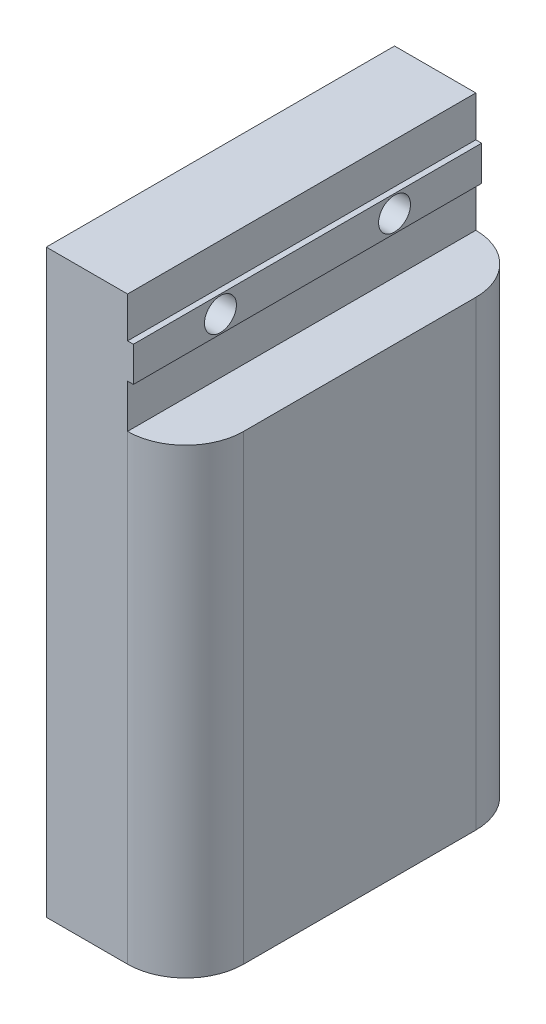
ISO-10303-21;
HEADER;
FILE_DESCRIPTION(('STEP AP214'),'2;1');
FILE_NAME('part.step','',(''),(''),'','','');
FILE_SCHEMA(('AUTOMOTIVE_DESIGN { 1 0 10303 214 1 1 1 1 }'));
ENDSEC;
DATA;
#1=APPLICATION_CONTEXT('core data for automotive mechanical design processes');
#2=APPLICATION_PROTOCOL_DEFINITION('international standard','automotive_design',2000,#1);
#3=PRODUCT_CONTEXT('',#1,'mechanical');
#4=PRODUCT('Part','Part','',(#3));
#5=PRODUCT_RELATED_PRODUCT_CATEGORY('part','',(#4));
#6=PRODUCT_DEFINITION_FORMATION('','',#4);
#7=PRODUCT_DEFINITION_CONTEXT('part definition',#1,'design');
#8=PRODUCT_DEFINITION('design','',#6,#7);
#9=PRODUCT_DEFINITION_SHAPE('','',#8);
#10=(LENGTH_UNIT() NAMED_UNIT(*) SI_UNIT(.MILLI.,.METRE.));
#11=(NAMED_UNIT(*) PLANE_ANGLE_UNIT() SI_UNIT($,.RADIAN.));
#12=(NAMED_UNIT(*) SI_UNIT($,.STERADIAN.) SOLID_ANGLE_UNIT());
#13=UNCERTAINTY_MEASURE_WITH_UNIT(LENGTH_MEASURE(1.E-05),#10,'distance_accuracy_value','');
#14=(GEOMETRIC_REPRESENTATION_CONTEXT(3) GLOBAL_UNCERTAINTY_ASSIGNED_CONTEXT((#13)) GLOBAL_UNIT_ASSIGNED_CONTEXT((#10,
#11,#12)) REPRESENTATION_CONTEXT('',''));
#15=CARTESIAN_POINT('',(0.,0.,0.));
#16=DIRECTION('',(0.,0.,1.));
#17=DIRECTION('',(1.,0.,0.));
#18=AXIS2_PLACEMENT_3D('',#15,#16,#17);
#19=CARTESIAN_POINT('',(24.,-10.,45.));
#20=DIRECTION('',(-1.,0.,0.));
#21=DIRECTION('',(0.,0.,1.));
#22=AXIS2_PLACEMENT_3D('',#19,#20,#21);
#23=CYLINDRICAL_SURFACE('',#22,2.75);
#24=CARTESIAN_POINT('',(15.,-10.,45.));
#25=DIRECTION('',(1.,0.,0.));
#26=DIRECTION('',(0.,0.,-1.));
#27=AXIS2_PLACEMENT_3D('',#24,#25,#26);
#28=CIRCLE('',#27,2.75);
#29=CARTESIAN_POINT('',(15.,-10.,42.25));
#30=VERTEX_POINT('',#29);
#31=EDGE_CURVE('E193',#30,#30,#28,.T.);
#32=ORIENTED_EDGE('',*,*,#31,.T.);
#33=EDGE_LOOP('',(#32));
#34=FACE_BOUND('',#33,.T.);
#35=CARTESIAN_POINT('',(8.,-10.,45.));
#36=DIRECTION('',(-1.,0.,0.));
#37=DIRECTION('',(0.,0.,1.));
#38=AXIS2_PLACEMENT_3D('',#35,#36,#37);
#39=CIRCLE('',#38,2.75);
#40=CARTESIAN_POINT('',(8.,-10.,47.75));
#41=VERTEX_POINT('',#40);
#42=EDGE_CURVE('E197',#41,#41,#39,.F.);
#43=ORIENTED_EDGE('',*,*,#42,.F.);
#44=EDGE_LOOP('',(#43));
#45=FACE_BOUND('',#44,.T.);
#46=ADVANCED_FACE('F39',(#34,#45),#23,.F.);
#47=CARTESIAN_POINT('',(24.,-10.,15.));
#48=DIRECTION('',(-1.,0.,0.));
#49=DIRECTION('',(0.,0.,1.));
#50=AXIS2_PLACEMENT_3D('',#47,#48,#49);
#51=CYLINDRICAL_SURFACE('',#50,2.75);
#52=CARTESIAN_POINT('',(15.,-10.,15.));
#53=DIRECTION('',(1.,0.,0.));
#54=DIRECTION('',(0.,0.,-1.));
#55=AXIS2_PLACEMENT_3D('',#52,#53,#54);
#56=CIRCLE('',#55,2.75);
#57=CARTESIAN_POINT('',(15.,-10.,12.25));
#58=VERTEX_POINT('',#57);
#59=EDGE_CURVE('E196',#58,#58,#56,.T.);
#60=ORIENTED_EDGE('',*,*,#59,.T.);
#61=EDGE_LOOP('',(#60));
#62=FACE_BOUND('',#61,.T.);
#63=CARTESIAN_POINT('',(8.,-10.,15.));
#64=DIRECTION('',(-1.,0.,0.));
#65=DIRECTION('',(0.,0.,1.));
#66=AXIS2_PLACEMENT_3D('',#63,#64,#65);
#67=CIRCLE('',#66,2.75);
#68=CARTESIAN_POINT('',(8.,-10.,17.75));
#69=VERTEX_POINT('',#68);
#70=EDGE_CURVE('E201',#69,#69,#67,.F.);
#71=ORIENTED_EDGE('',*,*,#70,.F.);
#72=EDGE_LOOP('',(#71));
#73=FACE_BOUND('',#72,.T.);
#74=ADVANCED_FACE('F264',(#62,#73),#51,.F.);
#75=CARTESIAN_POINT('',(14.,-20.5,60.));
#76=DIRECTION('',(-1.,0.,0.));
#77=DIRECTION('',(0.,0.,1.));
#78=AXIS2_PLACEMENT_3D('',#75,#76,#77);
#79=PLANE('',#78);
#80=DIRECTION('',(0.,0.,-1.));
#81=VECTOR('',#80,1.);
#82=CARTESIAN_POINT('',(14.,-13.,60.));
#83=LINE('',#82,#81);
#84=CARTESIAN_POINT('',(14.,-13.,60.));
#85=VERTEX_POINT('',#84);
#86=CARTESIAN_POINT('',(14.,-13.,0.));
#87=VERTEX_POINT('',#86);
#88=EDGE_CURVE('E200',#85,#87,#83,.T.);
#89=ORIENTED_EDGE('',*,*,#88,.F.);
#90=DIRECTION('',(0.,1.,0.));
#91=VECTOR('',#90,1.);
#92=CARTESIAN_POINT('',(14.,-20.5,60.));
#93=LINE('',#92,#91);
#94=CARTESIAN_POINT('',(14.,-20.5,60.));
#95=VERTEX_POINT('',#94);
#96=EDGE_CURVE('E149',#95,#85,#93,.T.);
#97=ORIENTED_EDGE('',*,*,#96,.F.);
#98=DIRECTION('',(0.,0.,-1.));
#99=VECTOR('',#98,1.);
#100=CARTESIAN_POINT('',(14.,-20.5,60.));
#101=LINE('',#100,#99);
#102=CARTESIAN_POINT('',(14.,-20.5,0.));
#103=VERTEX_POINT('',#102);
#104=EDGE_CURVE('E180',#95,#103,#101,.T.);
#105=ORIENTED_EDGE('',*,*,#104,.T.);
#106=DIRECTION('',(0.,1.,0.));
#107=VECTOR('',#106,1.);
#108=CARTESIAN_POINT('',(14.,-20.5,0.));
#109=LINE('',#108,#107);
#110=EDGE_CURVE('E172',#103,#87,#109,.T.);
#111=ORIENTED_EDGE('',*,*,#110,.T.);
#112=EDGE_LOOP('',(#89,#97,#105,#111));
#113=FACE_BOUND('',#112,.T.);
#114=ADVANCED_FACE('F229',(#113),#79,.F.);
#115=DIRECTION('',(0.,0.,1.));
#116=VECTOR('',#115,1.);
#117=CARTESIAN_POINT('',(14.,-7.,60.));
#118=LINE('',#117,#116);
#119=CARTESIAN_POINT('',(14.,-6.99999999999999,0.));
#120=VERTEX_POINT('',#119);
#121=CARTESIAN_POINT('',(14.,-6.99999999999999,60.));
#122=VERTEX_POINT('',#121);
#123=EDGE_CURVE('E144',#120,#122,#118,.T.);
#124=ORIENTED_EDGE('',*,*,#123,.F.);
#125=CARTESIAN_POINT('',(14.,0.,0.));
#126=VERTEX_POINT('',#125);
#127=EDGE_CURVE('E171',#120,#126,#109,.T.);
#128=ORIENTED_EDGE('',*,*,#127,.T.);
#129=DIRECTION('',(0.,0.,-1.));
#130=VECTOR('',#129,1.);
#131=CARTESIAN_POINT('',(14.,0.,60.));
#132=LINE('',#131,#130);
#133=CARTESIAN_POINT('',(14.,0.,60.));
#134=VERTEX_POINT('',#133);
#135=EDGE_CURVE('E177',#134,#126,#132,.T.);
#136=ORIENTED_EDGE('',*,*,#135,.F.);
#137=EDGE_CURVE('E165',#122,#134,#93,.T.);
#138=ORIENTED_EDGE('',*,*,#137,.F.);
#139=EDGE_LOOP('',(#124,#128,#136,#138));
#140=FACE_BOUND('',#139,.T.);
#141=ADVANCED_FACE('F247',(#140),#79,.F.);
#142=CARTESIAN_POINT('',(0.,0.,60.));
#143=DIRECTION('',(1.,0.,0.));
#144=DIRECTION('',(0.,1.,0.));
#145=AXIS2_PLACEMENT_3D('',#142,#143,#144);
#146=PLANE('',#145);
#147=CARTESIAN_POINT('',(0.,-10.,15.));
#148=DIRECTION('',(-1.,0.,0.));
#149=DIRECTION('',(0.,0.,1.));
#150=AXIS2_PLACEMENT_3D('',#147,#148,#149);
#151=CIRCLE('',#150,6.);
#152=CARTESIAN_POINT('',(0.,-10.,21.));
#153=VERTEX_POINT('',#152);
#154=EDGE_CURVE('E306',#153,#153,#151,.T.);
#155=ORIENTED_EDGE('',*,*,#154,.F.);
#156=EDGE_LOOP('',(#155));
#157=FACE_BOUND('',#156,.T.);
#158=CARTESIAN_POINT('',(0.,-10.,45.));
#159=DIRECTION('',(-1.,0.,0.));
#160=DIRECTION('',(0.,0.,1.));
#161=AXIS2_PLACEMENT_3D('',#158,#159,#160);
#162=CIRCLE('',#161,6.);
#163=CARTESIAN_POINT('',(0.,-10.,51.));
#164=VERTEX_POINT('',#163);
#165=EDGE_CURVE('E309',#164,#164,#162,.T.);
#166=ORIENTED_EDGE('',*,*,#165,.F.);
#167=EDGE_LOOP('',(#166));
#168=FACE_BOUND('',#167,.T.);
#169=DIRECTION('',(0.,-1.,0.));
#170=VECTOR('',#169,1.);
#171=CARTESIAN_POINT('',(0.,0.,0.));
#172=LINE('',#171,#170);
#173=CARTESIAN_POINT('',(0.,0.,0.));
#174=VERTEX_POINT('',#173);
#175=CARTESIAN_POINT('',(0.,-100.,0.));
#176=VERTEX_POINT('',#175);
#177=EDGE_CURVE('E150',#174,#176,#172,.T.);
#178=ORIENTED_EDGE('',*,*,#177,.T.);
#179=DIRECTION('',(0.,0.,-1.));
#180=VECTOR('',#179,1.);
#181=CARTESIAN_POINT('',(0.,-100.,60.));
#182=LINE('',#181,#180);
#183=CARTESIAN_POINT('',(0.,-100.,60.));
#184=VERTEX_POINT('',#183);
#185=EDGE_CURVE('E189',#184,#176,#182,.T.);
#186=ORIENTED_EDGE('',*,*,#185,.F.);
#187=DIRECTION('',(0.,-1.,0.));
#188=VECTOR('',#187,1.);
#189=CARTESIAN_POINT('',(0.,0.,60.));
#190=LINE('',#189,#188);
#191=CARTESIAN_POINT('',(0.,0.,60.));
#192=VERTEX_POINT('',#191);
#193=EDGE_CURVE('E159',#192,#184,#190,.T.);
#194=ORIENTED_EDGE('',*,*,#193,.F.);
#195=DIRECTION('',(0.,0.,-1.));
#196=VECTOR('',#195,1.);
#197=CARTESIAN_POINT('',(0.,0.,60.));
#198=LINE('',#197,#196);
#199=EDGE_CURVE('E168',#192,#174,#198,.T.);
#200=ORIENTED_EDGE('',*,*,#199,.T.);
#201=EDGE_LOOP('',(#178,#186,#194,#200));
#202=FACE_BOUND('',#201,.T.);
#203=ADVANCED_FACE('F255',(#157,#168,#202),#146,.F.);
#204=CARTESIAN_POINT('',(0.,-100.,60.));
#205=DIRECTION('',(0.,1.,0.));
#206=DIRECTION('',(0.,0.,1.));
#207=AXIS2_PLACEMENT_3D('',#204,#205,#206);
#208=PLANE('',#207);
#209=DIRECTION('',(1.,0.,0.));
#210=VECTOR('',#209,1.);
#211=CARTESIAN_POINT('',(0.,-100.,0.));
#212=LINE('',#211,#210);
#213=CARTESIAN_POINT('',(14.,-100.,0.));
#214=VERTEX_POINT('',#213);
#215=EDGE_CURVE('E153',#176,#214,#212,.T.);
#216=ORIENTED_EDGE('',*,*,#215,.T.);
#217=CARTESIAN_POINT('',(14.,-100.,10.));
#218=DIRECTION('',(0.,1.,0.));
#219=DIRECTION('',(0.,0.,1.));
#220=AXIS2_PLACEMENT_3D('',#217,#218,#219);
#221=CIRCLE('',#220,10.);
#222=CARTESIAN_POINT('',(24.,-100.,10.));
#223=VERTEX_POINT('',#222);
#224=EDGE_CURVE('E47',#214,#223,#221,.F.);
#225=ORIENTED_EDGE('',*,*,#224,.T.);
#226=DIRECTION('',(0.,0.,-1.));
#227=VECTOR('',#226,1.);
#228=CARTESIAN_POINT('',(24.,-100.,60.));
#229=LINE('',#228,#227);
#230=CARTESIAN_POINT('',(24.,-100.,50.));
#231=VERTEX_POINT('',#230);
#232=EDGE_CURVE('E186',#231,#223,#229,.T.);
#233=ORIENTED_EDGE('',*,*,#232,.F.);
#234=CARTESIAN_POINT('',(14.,-100.,50.));
#235=DIRECTION('',(0.,1.,0.));
#236=DIRECTION('',(0.,0.,1.));
#237=AXIS2_PLACEMENT_3D('',#234,#235,#236);
#238=CIRCLE('',#237,10.);
#239=CARTESIAN_POINT('',(14.,-100.,60.));
#240=VERTEX_POINT('',#239);
#241=EDGE_CURVE('E54',#231,#240,#238,.F.);
#242=ORIENTED_EDGE('',*,*,#241,.T.);
#243=DIRECTION('',(1.,0.,0.));
#244=VECTOR('',#243,1.);
#245=CARTESIAN_POINT('',(0.,-100.,60.));
#246=LINE('',#245,#244);
#247=EDGE_CURVE('E162',#184,#240,#246,.T.);
#248=ORIENTED_EDGE('',*,*,#247,.F.);
#249=ORIENTED_EDGE('',*,*,#185,.T.);
#250=EDGE_LOOP('',(#216,#225,#233,#242,#248,#249));
#251=FACE_BOUND('',#250,.T.);
#252=ADVANCED_FACE('F217',(#251),#208,.F.);
#253=CARTESIAN_POINT('',(24.,-100.,60.));
#254=DIRECTION('',(-1.,0.,0.));
#255=DIRECTION('',(0.,0.,1.));
#256=AXIS2_PLACEMENT_3D('',#253,#254,#255);
#257=PLANE('',#256);
#258=ORIENTED_EDGE('',*,*,#232,.T.);
#259=DIRECTION('',(0.,1.,0.));
#260=VECTOR('',#259,1.);
#261=CARTESIAN_POINT('',(24.,-100.,10.));
#262=LINE('',#261,#260);
#263=CARTESIAN_POINT('',(24.,-20.5,10.));
#264=VERTEX_POINT('',#263);
#265=EDGE_CURVE('E208',#223,#264,#262,.T.);
#266=ORIENTED_EDGE('',*,*,#265,.T.);
#267=DIRECTION('',(0.,0.,-1.));
#268=VECTOR('',#267,1.);
#269=CARTESIAN_POINT('',(24.,-20.5,60.));
#270=LINE('',#269,#268);
#271=CARTESIAN_POINT('',(24.,-20.5,50.));
#272=VERTEX_POINT('',#271);
#273=EDGE_CURVE('E183',#272,#264,#270,.T.);
#274=ORIENTED_EDGE('',*,*,#273,.F.);
#275=DIRECTION('',(0.,1.,0.));
#276=VECTOR('',#275,1.);
#277=CARTESIAN_POINT('',(24.,-100.,50.));
#278=LINE('',#277,#276);
#279=EDGE_CURVE('E192',#272,#231,#278,.F.);
#280=ORIENTED_EDGE('',*,*,#279,.T.);
#281=EDGE_LOOP('',(#258,#266,#274,#280));
#282=FACE_BOUND('',#281,.T.);
#283=ADVANCED_FACE('F221',(#282),#257,.F.);
#284=CARTESIAN_POINT('',(24.,-20.5,60.));
#285=DIRECTION('',(0.,-1.,0.));
#286=DIRECTION('',(0.,0.,-1.));
#287=AXIS2_PLACEMENT_3D('',#284,#285,#286);
#288=PLANE('',#287);
#289=ORIENTED_EDGE('',*,*,#273,.T.);
#290=CARTESIAN_POINT('',(14.,-20.5,10.));
#291=DIRECTION('',(0.,-1.,0.));
#292=DIRECTION('',(0.,0.,-1.));
#293=AXIS2_PLACEMENT_3D('',#290,#291,#292);
#294=CIRCLE('',#293,10.);
#295=EDGE_CURVE('E213',#264,#103,#294,.F.);
#296=ORIENTED_EDGE('',*,*,#295,.T.);
#297=ORIENTED_EDGE('',*,*,#104,.F.);
#298=CARTESIAN_POINT('',(14.,-20.5,50.));
#299=DIRECTION('',(0.,-1.,0.));
#300=DIRECTION('',(0.,0.,-1.));
#301=AXIS2_PLACEMENT_3D('',#298,#299,#300);
#302=CIRCLE('',#301,10.);
#303=EDGE_CURVE('E211',#95,#272,#302,.F.);
#304=ORIENTED_EDGE('',*,*,#303,.T.);
#305=EDGE_LOOP('',(#289,#296,#297,#304));
#306=FACE_BOUND('',#305,.T.);
#307=ADVANCED_FACE('F227',(#306),#288,.F.);
#308=CARTESIAN_POINT('',(14.,0.,60.));
#309=DIRECTION('',(0.,-1.,0.));
#310=DIRECTION('',(0.,0.,-1.));
#311=AXIS2_PLACEMENT_3D('',#308,#309,#310);
#312=PLANE('',#311);
#313=DIRECTION('',(-1.,0.,0.));
#314=VECTOR('',#313,1.);
#315=CARTESIAN_POINT('',(14.,0.,0.));
#316=LINE('',#315,#314);
#317=EDGE_CURVE('E163',#126,#174,#316,.T.);
#318=ORIENTED_EDGE('',*,*,#317,.T.);
#319=ORIENTED_EDGE('',*,*,#199,.F.);
#320=DIRECTION('',(-1.,0.,0.));
#321=VECTOR('',#320,1.);
#322=CARTESIAN_POINT('',(14.,0.,60.));
#323=LINE('',#322,#321);
#324=EDGE_CURVE('E167',#134,#192,#323,.T.);
#325=ORIENTED_EDGE('',*,*,#324,.F.);
#326=ORIENTED_EDGE('',*,*,#135,.T.);
#327=EDGE_LOOP('',(#318,#319,#325,#326));
#328=FACE_BOUND('',#327,.T.);
#329=ADVANCED_FACE('F250',(#328),#312,.F.);
#330=CARTESIAN_POINT('',(0.,0.,60.));
#331=DIRECTION('',(0.,0.,1.));
#332=DIRECTION('',(1.,0.,0.));
#333=AXIS2_PLACEMENT_3D('',#330,#331,#332);
#334=PLANE('',#333);
#335=ORIENTED_EDGE('',*,*,#247,.T.);
#336=DIRECTION('',(0.,1.,0.));
#337=VECTOR('',#336,1.);
#338=CARTESIAN_POINT('',(14.,-20.5,60.));
#339=LINE('',#338,#337);
#340=EDGE_CURVE('E11',#240,#95,#339,.T.);
#341=ORIENTED_EDGE('',*,*,#340,.T.);
#342=ORIENTED_EDGE('',*,*,#96,.T.);
#343=DIRECTION('',(-1.,0.,0.));
#344=VECTOR('',#343,1.);
#345=CARTESIAN_POINT('',(15.,-13.,60.));
#346=LINE('',#345,#344);
#347=CARTESIAN_POINT('',(15.,-13.,60.));
#348=VERTEX_POINT('',#347);
#349=EDGE_CURVE('E129',#348,#85,#346,.T.);
#350=ORIENTED_EDGE('',*,*,#349,.F.);
#351=DIRECTION('',(0.,-1.,0.));
#352=VECTOR('',#351,1.);
#353=CARTESIAN_POINT('',(15.,-7.,60.));
#354=LINE('',#353,#352);
#355=CARTESIAN_POINT('',(15.,-7.,60.));
#356=VERTEX_POINT('',#355);
#357=EDGE_CURVE('E135',#356,#348,#354,.T.);
#358=ORIENTED_EDGE('',*,*,#357,.F.);
#359=DIRECTION('',(-1.,0.,0.));
#360=VECTOR('',#359,1.);
#361=CARTESIAN_POINT('',(15.,-7.,60.));
#362=LINE('',#361,#360);
#363=EDGE_CURVE('E234',#356,#122,#362,.T.);
#364=ORIENTED_EDGE('',*,*,#363,.T.);
#365=ORIENTED_EDGE('',*,*,#137,.T.);
#366=ORIENTED_EDGE('',*,*,#324,.T.);
#367=ORIENTED_EDGE('',*,*,#193,.T.);
#368=EDGE_LOOP('',(#335,#341,#342,#350,#358,#364,#365,#366,#367));
#369=FACE_BOUND('',#368,.T.);
#370=ADVANCED_FACE('F147',(#369),#334,.T.);
#371=CARTESIAN_POINT('',(0.,0.,0.));
#372=DIRECTION('',(0.,0.,1.));
#373=DIRECTION('',(1.,0.,0.));
#374=AXIS2_PLACEMENT_3D('',#371,#372,#373);
#375=PLANE('',#374);
#376=ORIENTED_EDGE('',*,*,#110,.F.);
#377=DIRECTION('',(0.,1.,0.));
#378=VECTOR('',#377,1.);
#379=CARTESIAN_POINT('',(14.,0.,0.));
#380=LINE('',#379,#378);
#381=EDGE_CURVE('E62',#103,#214,#380,.F.);
#382=ORIENTED_EDGE('',*,*,#381,.T.);
#383=ORIENTED_EDGE('',*,*,#215,.F.);
#384=ORIENTED_EDGE('',*,*,#177,.F.);
#385=ORIENTED_EDGE('',*,*,#317,.F.);
#386=ORIENTED_EDGE('',*,*,#127,.F.);
#387=DIRECTION('',(-1.,0.,0.));
#388=VECTOR('',#387,1.);
#389=CARTESIAN_POINT('',(15.,-6.99999999999999,0.));
#390=LINE('',#389,#388);
#391=CARTESIAN_POINT('',(15.,-6.99999999999999,0.));
#392=VERTEX_POINT('',#391);
#393=EDGE_CURVE('E155',#392,#120,#390,.T.);
#394=ORIENTED_EDGE('',*,*,#393,.F.);
#395=DIRECTION('',(0.,1.,0.));
#396=VECTOR('',#395,1.);
#397=CARTESIAN_POINT('',(15.,-6.99999999999999,0.));
#398=LINE('',#397,#396);
#399=CARTESIAN_POINT('',(15.,-13.,0.));
#400=VERTEX_POINT('',#399);
#401=EDGE_CURVE('E134',#400,#392,#398,.T.);
#402=ORIENTED_EDGE('',*,*,#401,.F.);
#403=DIRECTION('',(-1.,0.,0.));
#404=VECTOR('',#403,1.);
#405=CARTESIAN_POINT('',(15.,-13.,0.));
#406=LINE('',#405,#404);
#407=EDGE_CURVE('E131',#400,#87,#406,.T.);
#408=ORIENTED_EDGE('',*,*,#407,.T.);
#409=EDGE_LOOP('',(#376,#382,#383,#384,#385,#386,#394,#402,#408));
#410=FACE_BOUND('',#409,.T.);
#411=ADVANCED_FACE('F230',(#410),#375,.F.);
#412=CARTESIAN_POINT('',(15.,-13.,60.));
#413=DIRECTION('',(0.,1.,0.));
#414=DIRECTION('',(0.,0.,1.));
#415=AXIS2_PLACEMENT_3D('',#412,#413,#414);
#416=PLANE('',#415);
#417=ORIENTED_EDGE('',*,*,#88,.T.);
#418=ORIENTED_EDGE('',*,*,#407,.F.);
#419=DIRECTION('',(0.,0.,-1.));
#420=VECTOR('',#419,1.);
#421=CARTESIAN_POINT('',(15.,-13.,60.));
#422=LINE('',#421,#420);
#423=EDGE_CURVE('E124',#348,#400,#422,.T.);
#424=ORIENTED_EDGE('',*,*,#423,.F.);
#425=ORIENTED_EDGE('',*,*,#349,.T.);
#426=EDGE_LOOP('',(#417,#418,#424,#425));
#427=FACE_BOUND('',#426,.T.);
#428=ADVANCED_FACE('F127',(#427),#416,.F.);
#429=CARTESIAN_POINT('',(15.,-7.,60.));
#430=DIRECTION('',(0.,-1.,0.));
#431=DIRECTION('',(0.,0.,-1.));
#432=AXIS2_PLACEMENT_3D('',#429,#430,#431);
#433=PLANE('',#432);
#434=ORIENTED_EDGE('',*,*,#123,.T.);
#435=ORIENTED_EDGE('',*,*,#363,.F.);
#436=DIRECTION('',(0.,0.,1.));
#437=VECTOR('',#436,1.);
#438=CARTESIAN_POINT('',(15.,-7.,60.));
#439=LINE('',#438,#437);
#440=EDGE_CURVE('E140',#392,#356,#439,.T.);
#441=ORIENTED_EDGE('',*,*,#440,.F.);
#442=ORIENTED_EDGE('',*,*,#393,.T.);
#443=EDGE_LOOP('',(#434,#435,#441,#442));
#444=FACE_BOUND('',#443,.T.);
#445=ADVANCED_FACE('F241',(#444),#433,.F.);
#446=CARTESIAN_POINT('',(15.,0.,0.));
#447=DIRECTION('',(1.,0.,0.));
#448=DIRECTION('',(0.,0.,-1.));
#449=AXIS2_PLACEMENT_3D('',#446,#447,#448);
#450=PLANE('',#449);
#451=ORIENTED_EDGE('',*,*,#59,.F.);
#452=EDGE_LOOP('',(#451));
#453=FACE_BOUND('',#452,.T.);
#454=ORIENTED_EDGE('',*,*,#31,.F.);
#455=EDGE_LOOP('',(#454));
#456=FACE_BOUND('',#455,.T.);
#457=ORIENTED_EDGE('',*,*,#357,.T.);
#458=ORIENTED_EDGE('',*,*,#423,.T.);
#459=ORIENTED_EDGE('',*,*,#401,.T.);
#460=ORIENTED_EDGE('',*,*,#440,.T.);
#461=EDGE_LOOP('',(#457,#458,#459,#460));
#462=FACE_BOUND('',#461,.T.);
#463=ADVANCED_FACE('F138',(#453,#456,#462),#450,.T.);
#464=CARTESIAN_POINT('',(8.,-10.,15.));
#465=DIRECTION('',(-1.,0.,0.));
#466=DIRECTION('',(0.,0.,1.));
#467=AXIS2_PLACEMENT_3D('',#464,#465,#466);
#468=PLANE('',#467);
#469=CARTESIAN_POINT('',(8.,-10.,15.));
#470=DIRECTION('',(-1.,0.,0.));
#471=DIRECTION('',(0.,0.,1.));
#472=AXIS2_PLACEMENT_3D('',#469,#470,#471);
#473=CIRCLE('',#472,6.);
#474=CARTESIAN_POINT('',(8.,-10.,21.));
#475=VERTEX_POINT('',#474);
#476=EDGE_CURVE('E204',#475,#475,#473,.T.);
#477=ORIENTED_EDGE('',*,*,#476,.T.);
#478=EDGE_LOOP('',(#477));
#479=FACE_BOUND('',#478,.T.);
#480=ORIENTED_EDGE('',*,*,#70,.T.);
#481=EDGE_LOOP('',(#480));
#482=FACE_BOUND('',#481,.T.);
#483=ADVANCED_FACE('F277',(#479,#482),#468,.T.);
#484=CARTESIAN_POINT('',(8.,-10.,15.));
#485=DIRECTION('',(-1.,0.,0.));
#486=DIRECTION('',(0.,0.,1.));
#487=AXIS2_PLACEMENT_3D('',#484,#485,#486);
#488=CYLINDRICAL_SURFACE('',#487,6.);
#489=ORIENTED_EDGE('',*,*,#476,.F.);
#490=EDGE_LOOP('',(#489));
#491=FACE_BOUND('',#490,.T.);
#492=ORIENTED_EDGE('',*,*,#154,.T.);
#493=EDGE_LOOP('',(#492));
#494=FACE_BOUND('',#493,.T.);
#495=ADVANCED_FACE('F322',(#491,#494),#488,.F.);
#496=CARTESIAN_POINT('',(8.,-10.,45.));
#497=DIRECTION('',(-1.,0.,0.));
#498=DIRECTION('',(0.,0.,1.));
#499=AXIS2_PLACEMENT_3D('',#496,#497,#498);
#500=PLANE('',#499);
#501=CARTESIAN_POINT('',(8.,-10.,45.));
#502=DIRECTION('',(-1.,0.,0.));
#503=DIRECTION('',(0.,0.,1.));
#504=AXIS2_PLACEMENT_3D('',#501,#502,#503);
#505=CIRCLE('',#504,6.);
#506=CARTESIAN_POINT('',(8.,-10.,51.));
#507=VERTEX_POINT('',#506);
#508=EDGE_CURVE('E311',#507,#507,#505,.T.);
#509=ORIENTED_EDGE('',*,*,#508,.T.);
#510=EDGE_LOOP('',(#509));
#511=FACE_BOUND('',#510,.T.);
#512=ORIENTED_EDGE('',*,*,#42,.T.);
#513=EDGE_LOOP('',(#512));
#514=FACE_BOUND('',#513,.T.);
#515=ADVANCED_FACE('F325',(#511,#514),#500,.T.);
#516=CARTESIAN_POINT('',(8.,-10.,45.));
#517=DIRECTION('',(-1.,0.,0.));
#518=DIRECTION('',(0.,0.,1.));
#519=AXIS2_PLACEMENT_3D('',#516,#517,#518);
#520=CYLINDRICAL_SURFACE('',#519,6.);
#521=ORIENTED_EDGE('',*,*,#508,.F.);
#522=EDGE_LOOP('',(#521));
#523=FACE_BOUND('',#522,.T.);
#524=ORIENTED_EDGE('',*,*,#165,.T.);
#525=EDGE_LOOP('',(#524));
#526=FACE_BOUND('',#525,.T.);
#527=ADVANCED_FACE('F262',(#523,#526),#520,.F.);
#528=CARTESIAN_POINT('',(14.,-100.,10.));
#529=DIRECTION('',(0.,1.,0.));
#530=DIRECTION('',(0.,0.,1.));
#531=AXIS2_PLACEMENT_3D('',#528,#529,#530);
#532=CYLINDRICAL_SURFACE('',#531,10.);
#533=ORIENTED_EDGE('',*,*,#224,.F.);
#534=ORIENTED_EDGE('',*,*,#381,.F.);
#535=ORIENTED_EDGE('',*,*,#295,.F.);
#536=ORIENTED_EDGE('',*,*,#265,.F.);
#537=EDGE_LOOP('',(#533,#534,#535,#536));
#538=FACE_BOUND('',#537,.T.);
#539=ADVANCED_FACE('F224',(#538),#532,.T.);
#540=CARTESIAN_POINT('',(14.,0.,50.));
#541=DIRECTION('',(0.,-1.,0.));
#542=DIRECTION('',(0.,0.,-1.));
#543=AXIS2_PLACEMENT_3D('',#540,#541,#542);
#544=CYLINDRICAL_SURFACE('',#543,10.);
#545=ORIENTED_EDGE('',*,*,#241,.F.);
#546=ORIENTED_EDGE('',*,*,#279,.F.);
#547=ORIENTED_EDGE('',*,*,#303,.F.);
#548=ORIENTED_EDGE('',*,*,#340,.F.);
#549=EDGE_LOOP('',(#545,#546,#547,#548));
#550=FACE_BOUND('',#549,.T.);
#551=ADVANCED_FACE('F41',(#550),#544,.T.);
#552=CLOSED_SHELL('',(#46,#74,#114,#141,#203,#252,#283,#307,#329,#370,#411,#428,#445,#463,#483,
#495,#515,#527,#539,#551));
#553=MANIFOLD_SOLID_BREP('B2',#552);
#554=ADVANCED_BREP_SHAPE_REPRESENTATION('',(#18,#553),#14);
#555=SHAPE_DEFINITION_REPRESENTATION(#9,#554);
ENDSEC;
END-ISO-10303-21;
